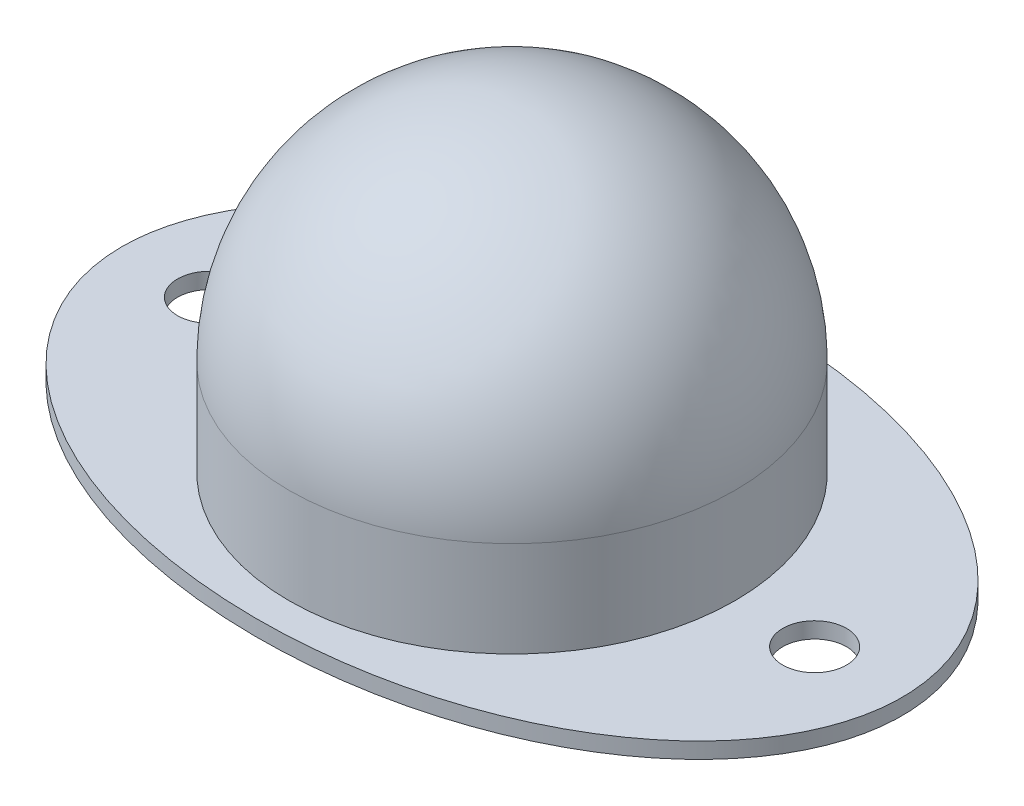
ISO-10303-21;
HEADER;
FILE_DESCRIPTION(('STEP AP214'),'2;1');
FILE_NAME('part.step','',(''),(''),'','','');
FILE_SCHEMA(('AUTOMOTIVE_DESIGN { 1 0 10303 214 1 1 1 1 }'));
ENDSEC;
DATA;
#1=APPLICATION_CONTEXT('core data for automotive mechanical design processes');
#2=APPLICATION_PROTOCOL_DEFINITION('international standard','automotive_design',2000,#1);
#3=PRODUCT_CONTEXT('',#1,'mechanical');
#4=PRODUCT('Part','Part','',(#3));
#5=PRODUCT_RELATED_PRODUCT_CATEGORY('part','',(#4));
#6=PRODUCT_DEFINITION_FORMATION('','',#4);
#7=PRODUCT_DEFINITION_CONTEXT('part definition',#1,'design');
#8=PRODUCT_DEFINITION('design','',#6,#7);
#9=PRODUCT_DEFINITION_SHAPE('','',#8);
#10=(LENGTH_UNIT() NAMED_UNIT(*) SI_UNIT(.MILLI.,.METRE.));
#11=(NAMED_UNIT(*) PLANE_ANGLE_UNIT() SI_UNIT($,.RADIAN.));
#12=(NAMED_UNIT(*) SI_UNIT($,.STERADIAN.) SOLID_ANGLE_UNIT());
#13=UNCERTAINTY_MEASURE_WITH_UNIT(LENGTH_MEASURE(1.E-05),#10,'distance_accuracy_value','');
#14=(GEOMETRIC_REPRESENTATION_CONTEXT(3) GLOBAL_UNCERTAINTY_ASSIGNED_CONTEXT((#13)) GLOBAL_UNIT_ASSIGNED_CONTEXT((#10,
#11,#12)) REPRESENTATION_CONTEXT('',''));
#15=CARTESIAN_POINT('',(0.,0.,0.));
#16=DIRECTION('',(0.,0.,1.));
#17=DIRECTION('',(1.,0.,0.));
#18=AXIS2_PLACEMENT_3D('',#15,#16,#17);
#19=CARTESIAN_POINT('',(0.,1.,0.));
#20=DIRECTION('',(0.,1.,0.));
#21=DIRECTION('',(-1.,0.,0.));
#22=AXIS2_PLACEMENT_3D('',#19,#20,#21);
#23=ELLIPSE('',#22,24.5,16.);
#24=DIRECTION('',(0.,-1.,0.));
#25=VECTOR('',#24,1.);
#26=SURFACE_OF_LINEAR_EXTRUSION('',#23,#25);
#27=CARTESIAN_POINT('',(-24.5,1.,0.));
#28=VERTEX_POINT('',#27);
#29=EDGE_CURVE('E53',#28,#28,#23,.T.);
#30=ORIENTED_EDGE('',*,*,#29,.F.);
#31=EDGE_LOOP('',(#30));
#32=FACE_BOUND('',#31,.T.);
#33=CARTESIAN_POINT('',(0.,0.,0.));
#34=DIRECTION('',(0.,1.,0.));
#35=DIRECTION('',(-1.,0.,0.));
#36=AXIS2_PLACEMENT_3D('',#33,#34,#35);
#37=ELLIPSE('',#36,24.5,16.);
#38=CARTESIAN_POINT('',(-24.5,0.,0.));
#39=VERTEX_POINT('',#38);
#40=EDGE_CURVE('E58',#39,#39,#37,.T.);
#41=ORIENTED_EDGE('',*,*,#40,.T.);
#42=EDGE_LOOP('',(#41));
#43=FACE_BOUND('',#42,.T.);
#44=ADVANCED_FACE('F42',(#32,#43),#26,.F.);
#45=CARTESIAN_POINT('',(0.,1.,0.));
#46=DIRECTION('',(0.,1.,0.));
#47=DIRECTION('',(0.,0.,1.));
#48=AXIS2_PLACEMENT_3D('',#45,#46,#47);
#49=PLANE('',#48);
#50=CARTESIAN_POINT('',(-19.,1.,0.));
#51=DIRECTION('',(0.,1.,0.));
#52=DIRECTION('',(0.,0.,1.));
#53=AXIS2_PLACEMENT_3D('',#50,#51,#52);
#54=CIRCLE('',#53,2.);
#55=CARTESIAN_POINT('',(-19.,1.,2.));
#56=VERTEX_POINT('',#55);
#57=EDGE_CURVE('E93',#56,#56,#54,.T.);
#58=ORIENTED_EDGE('',*,*,#57,.F.);
#59=EDGE_LOOP('',(#58));
#60=FACE_BOUND('',#59,.T.);
#61=CARTESIAN_POINT('',(19.,1.,0.));
#62=DIRECTION('',(0.,1.,0.));
#63=DIRECTION('',(0.,0.,1.));
#64=AXIS2_PLACEMENT_3D('',#61,#62,#63);
#65=CIRCLE('',#64,2.);
#66=CARTESIAN_POINT('',(19.,1.,2.));
#67=VERTEX_POINT('',#66);
#68=EDGE_CURVE('E94',#67,#67,#65,.T.);
#69=ORIENTED_EDGE('',*,*,#68,.F.);
#70=EDGE_LOOP('',(#69));
#71=FACE_BOUND('',#70,.T.);
#72=CARTESIAN_POINT('',(0.,1.,0.));
#73=DIRECTION('',(0.,1.,0.));
#74=DIRECTION('',(0.,0.,1.));
#75=AXIS2_PLACEMENT_3D('',#72,#73,#74);
#76=CIRCLE('',#75,14.);
#77=CARTESIAN_POINT('',(0.,1.,14.));
#78=VERTEX_POINT('',#77);
#79=EDGE_CURVE('E49',#78,#78,#76,.T.);
#80=ORIENTED_EDGE('',*,*,#79,.F.);
#81=EDGE_LOOP('',(#80));
#82=FACE_BOUND('',#81,.T.);
#83=ORIENTED_EDGE('',*,*,#29,.T.);
#84=EDGE_LOOP('',(#83));
#85=FACE_BOUND('',#84,.T.);
#86=ADVANCED_FACE('F66',(#60,#71,#82,#85),#49,.T.);
#87=CARTESIAN_POINT('',(0.,0.,0.));
#88=DIRECTION('',(0.,1.,0.));
#89=DIRECTION('',(0.,0.,1.));
#90=AXIS2_PLACEMENT_3D('',#87,#88,#89);
#91=PLANE('',#90);
#92=CARTESIAN_POINT('',(-19.,0.,0.));
#93=DIRECTION('',(0.,1.,0.));
#94=DIRECTION('',(0.,0.,1.));
#95=AXIS2_PLACEMENT_3D('',#92,#93,#94);
#96=CIRCLE('',#95,2.);
#97=CARTESIAN_POINT('',(-19.,0.,2.));
#98=VERTEX_POINT('',#97);
#99=EDGE_CURVE('E90',#98,#98,#96,.T.);
#100=ORIENTED_EDGE('',*,*,#99,.T.);
#101=EDGE_LOOP('',(#100));
#102=FACE_BOUND('',#101,.T.);
#103=CARTESIAN_POINT('',(19.,0.,0.));
#104=DIRECTION('',(0.,1.,0.));
#105=DIRECTION('',(0.,0.,1.));
#106=AXIS2_PLACEMENT_3D('',#103,#104,#105);
#107=CIRCLE('',#106,2.);
#108=CARTESIAN_POINT('',(19.,0.,2.));
#109=VERTEX_POINT('',#108);
#110=EDGE_CURVE('E61',#109,#109,#107,.T.);
#111=ORIENTED_EDGE('',*,*,#110,.T.);
#112=EDGE_LOOP('',(#111));
#113=FACE_BOUND('',#112,.T.);
#114=ORIENTED_EDGE('',*,*,#40,.F.);
#115=EDGE_LOOP('',(#114));
#116=FACE_BOUND('',#115,.T.);
#117=ADVANCED_FACE('F68',(#102,#113,#116),#91,.F.);
#118=CARTESIAN_POINT('',(0.,21.,0.));
#119=DIRECTION('',(0.,-1.,0.));
#120=DIRECTION('',(0.,0.,-1.));
#121=AXIS2_PLACEMENT_3D('',#118,#119,#120);
#122=CYLINDRICAL_SURFACE('',#121,14.);
#123=CARTESIAN_POINT('',(0.,7.,0.));
#124=DIRECTION('',(0.,-1.,0.));
#125=DIRECTION('',(0.,0.,-1.));
#126=AXIS2_PLACEMENT_3D('',#123,#124,#125);
#127=CIRCLE('',#126,14.);
#128=CARTESIAN_POINT('',(0.,7.,-14.));
#129=VERTEX_POINT('',#128);
#130=EDGE_CURVE('E10',#129,#129,#127,.T.);
#131=ORIENTED_EDGE('',*,*,#130,.T.);
#132=EDGE_LOOP('',(#131));
#133=FACE_BOUND('',#132,.T.);
#134=ORIENTED_EDGE('',*,*,#79,.T.);
#135=EDGE_LOOP('',(#134));
#136=FACE_BOUND('',#135,.T.);
#137=ADVANCED_FACE('F71',(#133,#136),#122,.T.);
#138=CARTESIAN_POINT('',(0.,7.,0.));
#139=DIRECTION('',(0.,1.,0.));
#140=DIRECTION('',(0.,0.,1.));
#141=AXIS2_PLACEMENT_3D('',#138,#139,#140);
#142=SPHERICAL_SURFACE('',#141,14.);
#143=ORIENTED_EDGE('',*,*,#130,.F.);
#144=EDGE_LOOP('',(#143));
#145=FACE_BOUND('',#144,.T.);
#146=ADVANCED_FACE('F44',(#145),#142,.T.);
#147=CARTESIAN_POINT('',(19.,0.,0.));
#148=DIRECTION('',(0.,1.,0.));
#149=DIRECTION('',(0.,0.,1.));
#150=AXIS2_PLACEMENT_3D('',#147,#148,#149);
#151=CYLINDRICAL_SURFACE('',#150,2.);
#152=ORIENTED_EDGE('',*,*,#110,.F.);
#153=EDGE_LOOP('',(#152));
#154=FACE_BOUND('',#153,.T.);
#155=ORIENTED_EDGE('',*,*,#68,.T.);
#156=EDGE_LOOP('',(#155));
#157=FACE_BOUND('',#156,.T.);
#158=ADVANCED_FACE('F78',(#154,#157),#151,.F.);
#159=CARTESIAN_POINT('',(-19.,0.,0.));
#160=DIRECTION('',(0.,1.,0.));
#161=DIRECTION('',(0.,0.,1.));
#162=AXIS2_PLACEMENT_3D('',#159,#160,#161);
#163=CYLINDRICAL_SURFACE('',#162,2.);
#164=ORIENTED_EDGE('',*,*,#99,.F.);
#165=EDGE_LOOP('',(#164));
#166=FACE_BOUND('',#165,.T.);
#167=ORIENTED_EDGE('',*,*,#57,.T.);
#168=EDGE_LOOP('',(#167));
#169=FACE_BOUND('',#168,.T.);
#170=ADVANCED_FACE('F81',(#166,#169),#163,.F.);
#171=CLOSED_SHELL('',(#44,#86,#117,#137,#146,#158,#170));
#172=MANIFOLD_SOLID_BREP('B2',#171);
#173=ADVANCED_BREP_SHAPE_REPRESENTATION('',(#18,#172),#14);
#174=SHAPE_DEFINITION_REPRESENTATION(#9,#173);
ENDSEC;
END-ISO-10303-21;
